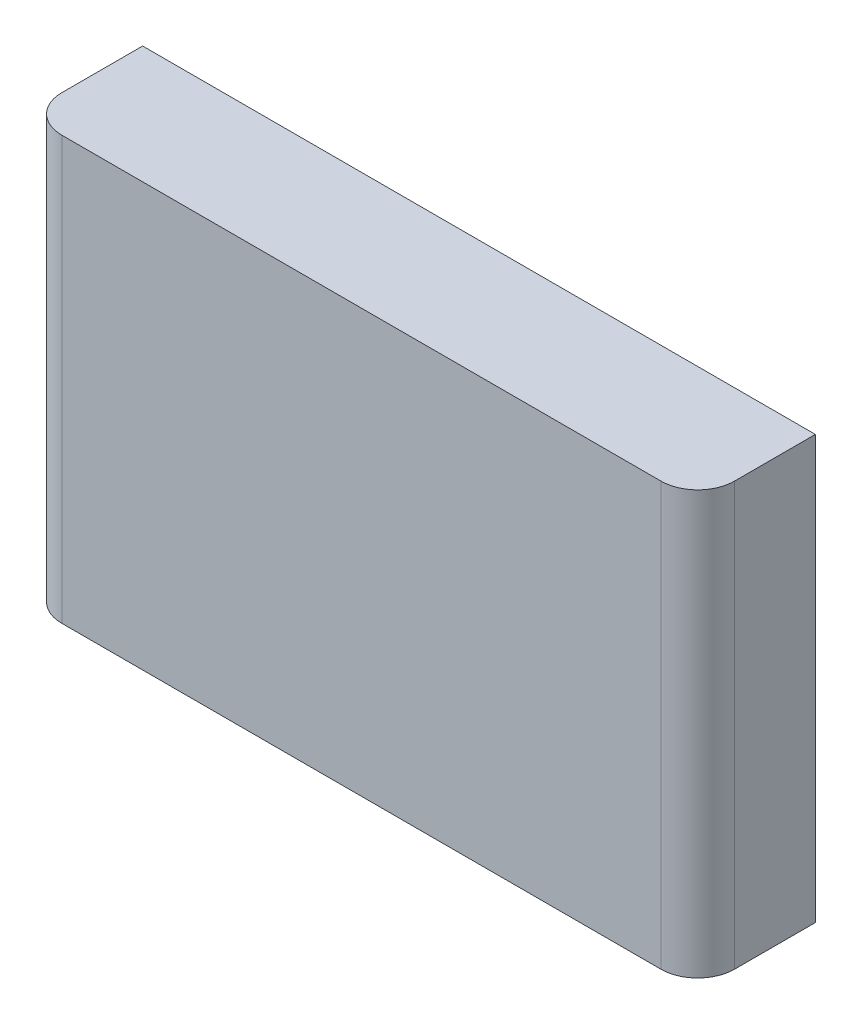
ISO-10303-21;
HEADER;
FILE_DESCRIPTION(('STEP AP214'),'2;1');
FILE_NAME('part.step','',(''),(''),'','','');
FILE_SCHEMA(('AUTOMOTIVE_DESIGN { 1 0 10303 214 1 1 1 1 }'));
ENDSEC;
DATA;
#1=APPLICATION_CONTEXT('core data for automotive mechanical design processes');
#2=APPLICATION_PROTOCOL_DEFINITION('international standard','automotive_design',2000,#1);
#3=PRODUCT_CONTEXT('',#1,'mechanical');
#4=PRODUCT('Part','Part','',(#3));
#5=PRODUCT_RELATED_PRODUCT_CATEGORY('part','',(#4));
#6=PRODUCT_DEFINITION_FORMATION('','',#4);
#7=PRODUCT_DEFINITION_CONTEXT('part definition',#1,'design');
#8=PRODUCT_DEFINITION('design','',#6,#7);
#9=PRODUCT_DEFINITION_SHAPE('','',#8);
#10=(LENGTH_UNIT() NAMED_UNIT(*) SI_UNIT(.MILLI.,.METRE.));
#11=(NAMED_UNIT(*) PLANE_ANGLE_UNIT() SI_UNIT($,.RADIAN.));
#12=(NAMED_UNIT(*) SI_UNIT($,.STERADIAN.) SOLID_ANGLE_UNIT());
#13=UNCERTAINTY_MEASURE_WITH_UNIT(LENGTH_MEASURE(1.E-05),#10,'distance_accuracy_value','');
#14=(GEOMETRIC_REPRESENTATION_CONTEXT(3) GLOBAL_UNCERTAINTY_ASSIGNED_CONTEXT((#13)) GLOBAL_UNIT_ASSIGNED_CONTEXT((#10,
#11,#12)) REPRESENTATION_CONTEXT('',''));
#15=CARTESIAN_POINT('',(0.,0.,0.));
#16=DIRECTION('',(0.,0.,1.));
#17=DIRECTION('',(1.,0.,0.));
#18=AXIS2_PLACEMENT_3D('',#15,#16,#17);
#19=CARTESIAN_POINT('',(-45.75,-28.75,16.));
#20=DIRECTION('',(1.,0.,0.));
#21=DIRECTION('',(0.,0.,-1.));
#22=AXIS2_PLACEMENT_3D('',#19,#20,#21);
#23=PLANE('',#22);
#24=DIRECTION('',(0.,0.,-1.));
#25=VECTOR('',#24,1.);
#26=CARTESIAN_POINT('',(-45.75,-28.75,16.));
#27=LINE('',#26,#25);
#28=CARTESIAN_POINT('',(-45.75,-28.75,11.));
#29=VERTEX_POINT('',#28);
#30=CARTESIAN_POINT('',(-45.75,-28.75,0.));
#31=VERTEX_POINT('',#30);
#32=EDGE_CURVE('E107',#29,#31,#27,.T.);
#33=ORIENTED_EDGE('',*,*,#32,.F.);
#34=DIRECTION('',(0.,-1.,0.));
#35=VECTOR('',#34,1.);
#36=CARTESIAN_POINT('',(-45.75,28.75,11.));
#37=LINE('',#36,#35);
#38=CARTESIAN_POINT('',(-45.75,28.75,11.));
#39=VERTEX_POINT('',#38);
#40=EDGE_CURVE('E72',#29,#39,#37,.F.);
#41=ORIENTED_EDGE('',*,*,#40,.T.);
#42=DIRECTION('',(0.,0.,-1.));
#43=VECTOR('',#42,1.);
#44=CARTESIAN_POINT('',(-45.75,28.75,16.));
#45=LINE('',#44,#43);
#46=CARTESIAN_POINT('',(-45.75,28.75,0.));
#47=VERTEX_POINT('',#46);
#48=EDGE_CURVE('E129',#39,#47,#45,.T.);
#49=ORIENTED_EDGE('',*,*,#48,.T.);
#50=DIRECTION('',(0.,-1.,0.));
#51=VECTOR('',#50,1.);
#52=CARTESIAN_POINT('',(-45.75,-28.75,0.));
#53=LINE('',#52,#51);
#54=EDGE_CURVE('E124',#47,#31,#53,.T.);
#55=ORIENTED_EDGE('',*,*,#54,.T.);
#56=EDGE_LOOP('',(#33,#41,#49,#55));
#57=FACE_BOUND('',#56,.T.);
#58=ADVANCED_FACE('F42',(#57),#23,.F.);
#59=CARTESIAN_POINT('',(45.75,-28.75,16.));
#60=DIRECTION('',(0.,1.,0.));
#61=DIRECTION('',(-1.,0.,0.));
#62=AXIS2_PLACEMENT_3D('',#59,#60,#61);
#63=PLANE('',#62);
#64=DIRECTION('',(1.,0.,0.));
#65=VECTOR('',#64,1.);
#66=CARTESIAN_POINT('',(45.75,-28.75,16.));
#67=LINE('',#66,#65);
#68=CARTESIAN_POINT('',(-40.75,-28.75,16.));
#69=VERTEX_POINT('',#68);
#70=CARTESIAN_POINT('',(40.75,-28.75,16.));
#71=VERTEX_POINT('',#70);
#72=EDGE_CURVE('E144',#69,#71,#67,.T.);
#73=ORIENTED_EDGE('',*,*,#72,.F.);
#74=CARTESIAN_POINT('',(-40.75,-28.75,11.));
#75=DIRECTION('',(0.,1.,0.));
#76=DIRECTION('',(-1.,0.,0.));
#77=AXIS2_PLACEMENT_3D('',#74,#75,#76);
#78=CIRCLE('',#77,5.);
#79=EDGE_CURVE('E114',#69,#29,#78,.F.);
#80=ORIENTED_EDGE('',*,*,#79,.T.);
#81=ORIENTED_EDGE('',*,*,#32,.T.);
#82=DIRECTION('',(1.,0.,0.));
#83=VECTOR('',#82,1.);
#84=CARTESIAN_POINT('',(45.75,-28.75,0.));
#85=LINE('',#84,#83);
#86=CARTESIAN_POINT('',(45.75,-28.75,0.));
#87=VERTEX_POINT('',#86);
#88=EDGE_CURVE('E112',#31,#87,#85,.T.);
#89=ORIENTED_EDGE('',*,*,#88,.T.);
#90=DIRECTION('',(0.,0.,-1.));
#91=VECTOR('',#90,1.);
#92=CARTESIAN_POINT('',(45.75,-28.75,16.));
#93=LINE('',#92,#91);
#94=CARTESIAN_POINT('',(45.75,-28.75,11.));
#95=VERTEX_POINT('',#94);
#96=EDGE_CURVE('E118',#95,#87,#93,.T.);
#97=ORIENTED_EDGE('',*,*,#96,.F.);
#98=CARTESIAN_POINT('',(40.75,-28.75,11.));
#99=DIRECTION('',(0.,1.,0.));
#100=DIRECTION('',(-1.,0.,0.));
#101=AXIS2_PLACEMENT_3D('',#98,#99,#100);
#102=CIRCLE('',#101,5.);
#103=EDGE_CURVE('E159',#95,#71,#102,.F.);
#104=ORIENTED_EDGE('',*,*,#103,.T.);
#105=EDGE_LOOP('',(#73,#80,#81,#89,#97,#104));
#106=FACE_BOUND('',#105,.T.);
#107=ADVANCED_FACE('F110',(#106),#63,.F.);
#108=CARTESIAN_POINT('',(45.75,-28.75,16.));
#109=DIRECTION('',(-1.,0.,0.));
#110=DIRECTION('',(0.,0.,1.));
#111=AXIS2_PLACEMENT_3D('',#108,#109,#110);
#112=PLANE('',#111);
#113=DIRECTION('',(0.,0.,-1.));
#114=VECTOR('',#113,1.);
#115=CARTESIAN_POINT('',(45.75,28.75,16.));
#116=LINE('',#115,#114);
#117=CARTESIAN_POINT('',(45.75,28.75,11.));
#118=VERTEX_POINT('',#117);
#119=CARTESIAN_POINT('',(45.75,28.75,0.));
#120=VERTEX_POINT('',#119);
#121=EDGE_CURVE('E147',#118,#120,#116,.T.);
#122=ORIENTED_EDGE('',*,*,#121,.F.);
#123=DIRECTION('',(0.,1.,0.));
#124=VECTOR('',#123,1.);
#125=CARTESIAN_POINT('',(45.75,-28.75,11.));
#126=LINE('',#125,#124);
#127=EDGE_CURVE('E11',#118,#95,#126,.F.);
#128=ORIENTED_EDGE('',*,*,#127,.T.);
#129=ORIENTED_EDGE('',*,*,#96,.T.);
#130=DIRECTION('',(0.,1.,0.));
#131=VECTOR('',#130,1.);
#132=CARTESIAN_POINT('',(45.75,-28.75,0.));
#133=LINE('',#132,#131);
#134=EDGE_CURVE('E126',#87,#120,#133,.T.);
#135=ORIENTED_EDGE('',*,*,#134,.T.);
#136=EDGE_LOOP('',(#122,#128,#129,#135));
#137=FACE_BOUND('',#136,.T.);
#138=ADVANCED_FACE('F189',(#137),#112,.F.);
#139=CARTESIAN_POINT('',(45.75,28.75,16.));
#140=DIRECTION('',(0.,-1.,0.));
#141=DIRECTION('',(1.,0.,0.));
#142=AXIS2_PLACEMENT_3D('',#139,#140,#141);
#143=PLANE('',#142);
#144=ORIENTED_EDGE('',*,*,#48,.F.);
#145=CARTESIAN_POINT('',(-40.75,28.75,11.));
#146=DIRECTION('',(0.,-1.,0.));
#147=DIRECTION('',(1.,0.,0.));
#148=AXIS2_PLACEMENT_3D('',#145,#146,#147);
#149=CIRCLE('',#148,5.);
#150=CARTESIAN_POINT('',(-40.75,28.75,16.));
#151=VERTEX_POINT('',#150);
#152=EDGE_CURVE('E51',#39,#151,#149,.F.);
#153=ORIENTED_EDGE('',*,*,#152,.T.);
#154=DIRECTION('',(-1.,0.,0.));
#155=VECTOR('',#154,1.);
#156=CARTESIAN_POINT('',(45.75,28.75,16.));
#157=LINE('',#156,#155);
#158=CARTESIAN_POINT('',(40.75,28.75,16.));
#159=VERTEX_POINT('',#158);
#160=EDGE_CURVE('E136',#159,#151,#157,.T.);
#161=ORIENTED_EDGE('',*,*,#160,.F.);
#162=CARTESIAN_POINT('',(40.75,28.75,11.));
#163=DIRECTION('',(0.,-1.,0.));
#164=DIRECTION('',(1.,0.,0.));
#165=AXIS2_PLACEMENT_3D('',#162,#163,#164);
#166=CIRCLE('',#165,5.);
#167=EDGE_CURVE('E61',#159,#118,#166,.F.);
#168=ORIENTED_EDGE('',*,*,#167,.T.);
#169=ORIENTED_EDGE('',*,*,#121,.T.);
#170=DIRECTION('',(-1.,0.,0.));
#171=VECTOR('',#170,1.);
#172=CARTESIAN_POINT('',(45.75,28.75,0.));
#173=LINE('',#172,#171);
#174=EDGE_CURVE('E141',#120,#47,#173,.T.);
#175=ORIENTED_EDGE('',*,*,#174,.T.);
#176=EDGE_LOOP('',(#144,#153,#161,#168,#169,#175));
#177=FACE_BOUND('',#176,.T.);
#178=ADVANCED_FACE('F168',(#177),#143,.F.);
#179=CARTESIAN_POINT('',(0.,0.,16.));
#180=DIRECTION('',(0.,0.,1.));
#181=DIRECTION('',(1.,0.,0.));
#182=AXIS2_PLACEMENT_3D('',#179,#180,#181);
#183=PLANE('',#182);
#184=ORIENTED_EDGE('',*,*,#160,.T.);
#185=DIRECTION('',(0.,-1.,0.));
#186=VECTOR('',#185,1.);
#187=CARTESIAN_POINT('',(-40.75,-28.75,16.));
#188=LINE('',#187,#186);
#189=EDGE_CURVE('E155',#151,#69,#188,.T.);
#190=ORIENTED_EDGE('',*,*,#189,.T.);
#191=ORIENTED_EDGE('',*,*,#72,.T.);
#192=DIRECTION('',(0.,1.,0.));
#193=VECTOR('',#192,1.);
#194=CARTESIAN_POINT('',(40.75,28.75,16.));
#195=LINE('',#194,#193);
#196=EDGE_CURVE('E117',#71,#159,#195,.T.);
#197=ORIENTED_EDGE('',*,*,#196,.T.);
#198=EDGE_LOOP('',(#184,#190,#191,#197));
#199=FACE_BOUND('',#198,.T.);
#200=ADVANCED_FACE('F172',(#199),#183,.T.);
#201=CARTESIAN_POINT('',(0.,0.,0.));
#202=DIRECTION('',(0.,0.,1.));
#203=DIRECTION('',(1.,0.,0.));
#204=AXIS2_PLACEMENT_3D('',#201,#202,#203);
#205=PLANE('',#204);
#206=ORIENTED_EDGE('',*,*,#54,.F.);
#207=ORIENTED_EDGE('',*,*,#174,.F.);
#208=ORIENTED_EDGE('',*,*,#134,.F.);
#209=ORIENTED_EDGE('',*,*,#88,.F.);
#210=EDGE_LOOP('',(#206,#207,#208,#209));
#211=FACE_BOUND('',#210,.T.);
#212=ADVANCED_FACE('F122',(#211),#205,.F.);
#213=CARTESIAN_POINT('',(-40.75,0.,11.));
#214=DIRECTION('',(0.,1.,0.));
#215=DIRECTION('',(0.,0.,1.));
#216=AXIS2_PLACEMENT_3D('',#213,#214,#215);
#217=CYLINDRICAL_SURFACE('',#216,5.);
#218=ORIENTED_EDGE('',*,*,#152,.F.);
#219=ORIENTED_EDGE('',*,*,#40,.F.);
#220=ORIENTED_EDGE('',*,*,#79,.F.);
#221=ORIENTED_EDGE('',*,*,#189,.F.);
#222=EDGE_LOOP('',(#218,#219,#220,#221));
#223=FACE_BOUND('',#222,.T.);
#224=ADVANCED_FACE('F176',(#223),#217,.T.);
#225=CARTESIAN_POINT('',(40.75,0.,11.));
#226=DIRECTION('',(0.,-1.,0.));
#227=DIRECTION('',(0.,0.,-1.));
#228=AXIS2_PLACEMENT_3D('',#225,#226,#227);
#229=CYLINDRICAL_SURFACE('',#228,5.);
#230=ORIENTED_EDGE('',*,*,#103,.F.);
#231=ORIENTED_EDGE('',*,*,#127,.F.);
#232=ORIENTED_EDGE('',*,*,#167,.F.);
#233=ORIENTED_EDGE('',*,*,#196,.F.);
#234=EDGE_LOOP('',(#230,#231,#232,#233));
#235=FACE_BOUND('',#234,.T.);
#236=ADVANCED_FACE('F44',(#235),#229,.T.);
#237=CLOSED_SHELL('',(#58,#107,#138,#178,#200,#212,#224,#236));
#238=MANIFOLD_SOLID_BREP('B2',#237);
#239=ADVANCED_BREP_SHAPE_REPRESENTATION('',(#18,#238),#14);
#240=SHAPE_DEFINITION_REPRESENTATION(#9,#239);
ENDSEC;
END-ISO-10303-21;
